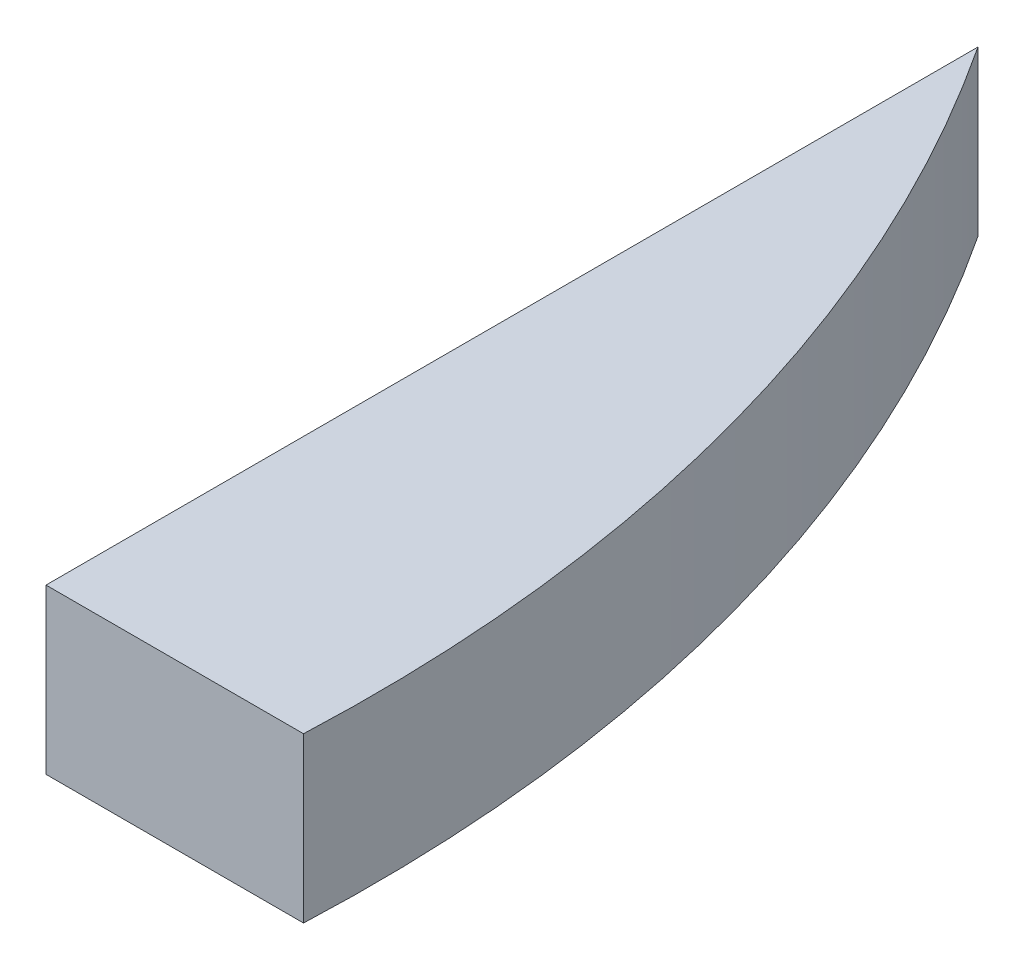
ISO-10303-21;
HEADER;
FILE_DESCRIPTION(('STEP AP214'),'2;1');
FILE_NAME('part.step','',(''),(''),'','','');
FILE_SCHEMA(('AUTOMOTIVE_DESIGN { 1 0 10303 214 1 1 1 1 }'));
ENDSEC;
DATA;
#1=APPLICATION_CONTEXT('core data for automotive mechanical design processes');
#2=APPLICATION_PROTOCOL_DEFINITION('international standard','automotive_design',2000,#1);
#3=PRODUCT_CONTEXT('',#1,'mechanical');
#4=PRODUCT('Part','Part','',(#3));
#5=PRODUCT_RELATED_PRODUCT_CATEGORY('part','',(#4));
#6=PRODUCT_DEFINITION_FORMATION('','',#4);
#7=PRODUCT_DEFINITION_CONTEXT('part definition',#1,'design');
#8=PRODUCT_DEFINITION('design','',#6,#7);
#9=PRODUCT_DEFINITION_SHAPE('','',#8);
#10=(LENGTH_UNIT() NAMED_UNIT(*) SI_UNIT(.MILLI.,.METRE.));
#11=(NAMED_UNIT(*) PLANE_ANGLE_UNIT() SI_UNIT($,.RADIAN.));
#12=(NAMED_UNIT(*) SI_UNIT($,.STERADIAN.) SOLID_ANGLE_UNIT());
#13=UNCERTAINTY_MEASURE_WITH_UNIT(LENGTH_MEASURE(1.E-05),#10,'distance_accuracy_value','');
#14=(GEOMETRIC_REPRESENTATION_CONTEXT(3) GLOBAL_UNCERTAINTY_ASSIGNED_CONTEXT((#13)) GLOBAL_UNIT_ASSIGNED_CONTEXT((#10,
#11,#12)) REPRESENTATION_CONTEXT('',''));
#15=CARTESIAN_POINT('',(0.,0.,0.));
#16=DIRECTION('',(0.,0.,1.));
#17=DIRECTION('',(1.,0.,0.));
#18=AXIS2_PLACEMENT_3D('',#15,#16,#17);
#19=CARTESIAN_POINT('',(0.,0.,-142.57));
#20=DIRECTION('',(-1.,0.,0.));
#21=DIRECTION('',(0.,0.,1.));
#22=AXIS2_PLACEMENT_3D('',#19,#20,#21);
#23=PLANE('',#22);
#24=DIRECTION('',(0.,0.,-1.));
#25=VECTOR('',#24,1.);
#26=CARTESIAN_POINT('',(0.,-25.8,-142.57));
#27=LINE('',#26,#25);
#28=CARTESIAN_POINT('',(0.,-25.8,0.));
#29=VERTEX_POINT('',#28);
#30=CARTESIAN_POINT('',(0.,-25.8,-146.66965461496));
#31=VERTEX_POINT('',#30);
#32=EDGE_CURVE('E77',#29,#31,#27,.T.);
#33=ORIENTED_EDGE('',*,*,#32,.F.);
#34=DIRECTION('',(0.,-1.,0.));
#35=VECTOR('',#34,1.);
#36=CARTESIAN_POINT('',(0.,0.,0.));
#37=LINE('',#36,#35);
#38=CARTESIAN_POINT('',(0.,0.,0.));
#39=VERTEX_POINT('',#38);
#40=EDGE_CURVE('E58',#39,#29,#37,.T.);
#41=ORIENTED_EDGE('',*,*,#40,.F.);
#42=DIRECTION('',(0.,0.,-1.));
#43=VECTOR('',#42,1.);
#44=CARTESIAN_POINT('',(0.,0.,0.));
#45=LINE('',#44,#43);
#46=CARTESIAN_POINT('',(0.,0.,-146.66965461496));
#47=VERTEX_POINT('',#46);
#48=EDGE_CURVE('E66',#39,#47,#45,.T.);
#49=ORIENTED_EDGE('',*,*,#48,.T.);
#50=DIRECTION('',(0.,-1.,0.));
#51=VECTOR('',#50,1.);
#52=CARTESIAN_POINT('',(0.,0.,-146.66965461496));
#53=LINE('',#52,#51);
#54=EDGE_CURVE('E11',#47,#31,#53,.T.);
#55=ORIENTED_EDGE('',*,*,#54,.T.);
#56=EDGE_LOOP('',(#33,#41,#49,#55));
#57=FACE_BOUND('',#56,.T.);
#58=ADVANCED_FACE('F47',(#57),#23,.T.);
#59=CARTESIAN_POINT('',(40.5244466223736,0.,0.));
#60=DIRECTION('',(0.,0.,1.));
#61=DIRECTION('',(1.,0.,0.));
#62=AXIS2_PLACEMENT_3D('',#59,#60,#61);
#63=PLANE('',#62);
#64=DIRECTION('',(-1.,0.,0.));
#65=VECTOR('',#64,1.);
#66=CARTESIAN_POINT('',(40.5244466223736,-25.8,0.));
#67=LINE('',#66,#65);
#68=CARTESIAN_POINT('',(40.5244466223736,-25.8,0.));
#69=VERTEX_POINT('',#68);
#70=EDGE_CURVE('E97',#69,#29,#67,.T.);
#71=ORIENTED_EDGE('',*,*,#70,.F.);
#72=DIRECTION('',(0.,-1.,0.));
#73=VECTOR('',#72,1.);
#74=CARTESIAN_POINT('',(40.5244466223736,0.,0.));
#75=LINE('',#74,#73);
#76=CARTESIAN_POINT('',(40.5244466223736,0.,0.));
#77=VERTEX_POINT('',#76);
#78=EDGE_CURVE('E51',#77,#69,#75,.T.);
#79=ORIENTED_EDGE('',*,*,#78,.F.);
#80=DIRECTION('',(-1.,0.,0.));
#81=VECTOR('',#80,1.);
#82=CARTESIAN_POINT('',(40.5244466223736,0.,0.));
#83=LINE('',#82,#81);
#84=EDGE_CURVE('E91',#77,#39,#83,.T.);
#85=ORIENTED_EDGE('',*,*,#84,.T.);
#86=ORIENTED_EDGE('',*,*,#40,.T.);
#87=EDGE_LOOP('',(#71,#79,#85,#86));
#88=FACE_BOUND('',#87,.T.);
#89=ADVANCED_FACE('F95',(#88),#63,.T.);
#90=CARTESIAN_POINT('',(-206.675925169769,0.,-10.6324032181906));
#91=DIRECTION('',(0.,-1.,0.));
#92=DIRECTION('',(0.,0.,-1.));
#93=AXIS2_PLACEMENT_3D('',#90,#91,#92);
#94=CYLINDRICAL_SURFACE('',#93,247.428922748267);
#95=CARTESIAN_POINT('',(-206.675925169769,-25.8,-10.6324032181906));
#96=DIRECTION('',(0.,-1.,0.));
#97=DIRECTION('',(0.,0.,-1.));
#98=AXIS2_PLACEMENT_3D('',#95,#96,#97);
#99=CIRCLE('',#98,247.428922748267);
#100=EDGE_CURVE('E82',#31,#69,#99,.T.);
#101=ORIENTED_EDGE('',*,*,#100,.F.);
#102=ORIENTED_EDGE('',*,*,#54,.F.);
#103=CARTESIAN_POINT('',(-206.675925169769,0.,-10.6324032181906));
#104=DIRECTION('',(0.,-1.,0.));
#105=DIRECTION('',(0.,0.,-1.));
#106=AXIS2_PLACEMENT_3D('',#103,#104,#105);
#107=CIRCLE('',#106,247.428922748267);
#108=EDGE_CURVE('E85',#47,#77,#107,.T.);
#109=ORIENTED_EDGE('',*,*,#108,.T.);
#110=ORIENTED_EDGE('',*,*,#78,.T.);
#111=EDGE_LOOP('',(#101,#102,#109,#110));
#112=FACE_BOUND('',#111,.T.);
#113=ADVANCED_FACE('F49',(#112),#94,.T.);
#114=CARTESIAN_POINT('',(-206.675925169769,0.,-10.6324032181906));
#115=DIRECTION('',(0.,-1.,0.));
#116=DIRECTION('',(0.,0.,-1.));
#117=AXIS2_PLACEMENT_3D('',#114,#115,#116);
#118=PLANE('',#117);
#119=ORIENTED_EDGE('',*,*,#108,.F.);
#120=ORIENTED_EDGE('',*,*,#48,.F.);
#121=ORIENTED_EDGE('',*,*,#84,.F.);
#122=EDGE_LOOP('',(#119,#120,#121));
#123=FACE_BOUND('',#122,.T.);
#124=ADVANCED_FACE('F99',(#123),#118,.F.);
#125=CARTESIAN_POINT('',(-206.675925169769,-25.8,-10.6324032181906));
#126=DIRECTION('',(0.,-1.,0.));
#127=DIRECTION('',(0.,0.,-1.));
#128=AXIS2_PLACEMENT_3D('',#125,#126,#127);
#129=PLANE('',#128);
#130=ORIENTED_EDGE('',*,*,#32,.T.);
#131=ORIENTED_EDGE('',*,*,#100,.T.);
#132=ORIENTED_EDGE('',*,*,#70,.T.);
#133=EDGE_LOOP('',(#130,#131,#132));
#134=FACE_BOUND('',#133,.T.);
#135=ADVANCED_FACE('F112',(#134),#129,.T.);
#136=CLOSED_SHELL('',(#58,#89,#113,#124,#135));
#137=MANIFOLD_SOLID_BREP('B2',#136);
#138=ADVANCED_BREP_SHAPE_REPRESENTATION('',(#18,#137),#14);
#139=SHAPE_DEFINITION_REPRESENTATION(#9,#138);
ENDSEC;
END-ISO-10303-21;
